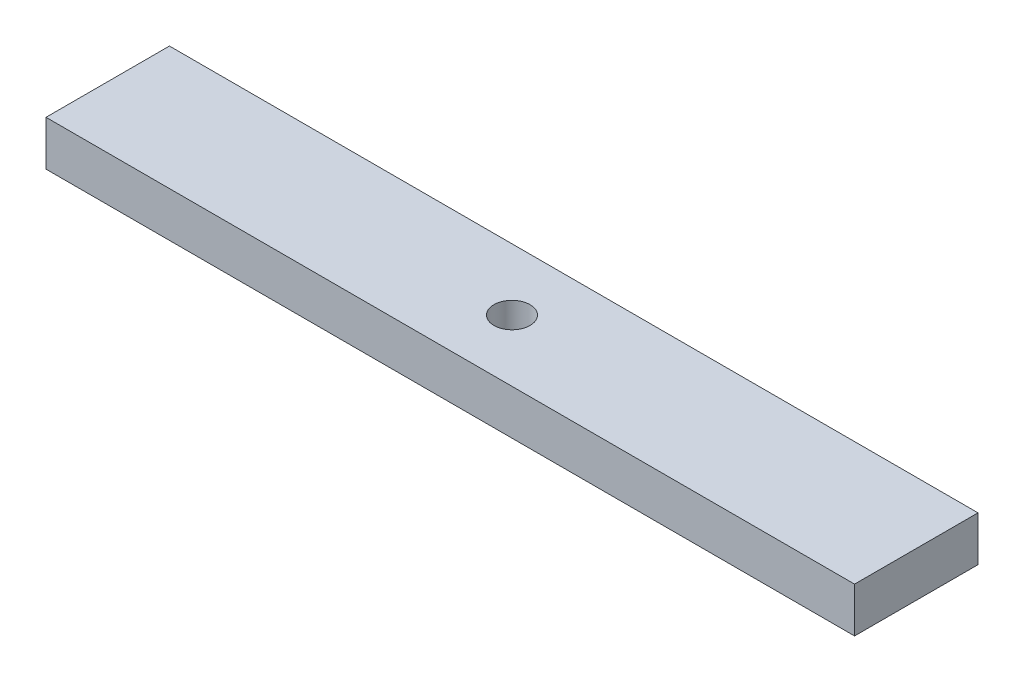
ISO-10303-21;
HEADER;
FILE_DESCRIPTION(('STEP AP214'),'2;1');
FILE_NAME('part.step','',(''),(''),'','','');
FILE_SCHEMA(('AUTOMOTIVE_DESIGN { 1 0 10303 214 1 1 1 1 }'));
ENDSEC;
DATA;
#1=APPLICATION_CONTEXT('core data for automotive mechanical design processes');
#2=APPLICATION_PROTOCOL_DEFINITION('international standard','automotive_design',2000,#1);
#3=PRODUCT_CONTEXT('',#1,'mechanical');
#4=PRODUCT('Part','Part','',(#3));
#5=PRODUCT_RELATED_PRODUCT_CATEGORY('part','',(#4));
#6=PRODUCT_DEFINITION_FORMATION('','',#4);
#7=PRODUCT_DEFINITION_CONTEXT('part definition',#1,'design');
#8=PRODUCT_DEFINITION('design','',#6,#7);
#9=PRODUCT_DEFINITION_SHAPE('','',#8);
#10=(LENGTH_UNIT() NAMED_UNIT(*) SI_UNIT(.MILLI.,.METRE.));
#11=(NAMED_UNIT(*) PLANE_ANGLE_UNIT() SI_UNIT($,.RADIAN.));
#12=(NAMED_UNIT(*) SI_UNIT($,.STERADIAN.) SOLID_ANGLE_UNIT());
#13=UNCERTAINTY_MEASURE_WITH_UNIT(LENGTH_MEASURE(1.E-05),#10,'distance_accuracy_value','');
#14=(GEOMETRIC_REPRESENTATION_CONTEXT(3) GLOBAL_UNCERTAINTY_ASSIGNED_CONTEXT((#13)) GLOBAL_UNIT_ASSIGNED_CONTEXT((#10,
#11,#12)) REPRESENTATION_CONTEXT('',''));
#15=CARTESIAN_POINT('',(0.,0.,0.));
#16=DIRECTION('',(0.,0.,1.));
#17=DIRECTION('',(1.,0.,0.));
#18=AXIS2_PLACEMENT_3D('',#15,#16,#17);
#19=CARTESIAN_POINT('',(0.,6.35,0.));
#20=DIRECTION('',(0.,-1.,0.));
#21=DIRECTION('',(0.,0.,-1.));
#22=AXIS2_PLACEMENT_3D('',#19,#20,#21);
#23=PLANE('',#22);
#24=DIRECTION('',(0.,0.,-1.));
#25=VECTOR('',#24,1.);
#26=CARTESIAN_POINT('',(57.1500000000001,6.35,8.72490000000001));
#27=LINE('',#26,#25);
#28=CARTESIAN_POINT('',(57.1500000000001,6.35,8.72490000000001));
#29=VERTEX_POINT('',#28);
#30=CARTESIAN_POINT('',(57.1500000000001,6.35,-8.72490000000002));
#31=VERTEX_POINT('',#30);
#32=EDGE_CURVE('E85',#29,#31,#27,.T.);
#33=ORIENTED_EDGE('',*,*,#32,.T.);
#34=DIRECTION('',(-1.,0.,0.));
#35=VECTOR('',#34,1.);
#36=CARTESIAN_POINT('',(-57.1499999999999,6.35,-8.72489999999999));
#37=LINE('',#36,#35);
#38=CARTESIAN_POINT('',(-57.1499999999999,6.35,-8.72489999999999));
#39=VERTEX_POINT('',#38);
#40=EDGE_CURVE('E80',#31,#39,#37,.T.);
#41=ORIENTED_EDGE('',*,*,#40,.T.);
#42=DIRECTION('',(0.,0.,1.));
#43=VECTOR('',#42,1.);
#44=CARTESIAN_POINT('',(-57.1499999999999,6.35,8.72490000000001));
#45=LINE('',#44,#43);
#46=CARTESIAN_POINT('',(-57.1499999999999,6.35,8.72490000000001));
#47=VERTEX_POINT('',#46);
#48=EDGE_CURVE('E83',#39,#47,#45,.T.);
#49=ORIENTED_EDGE('',*,*,#48,.T.);
#50=DIRECTION('',(1.,0.,0.));
#51=VECTOR('',#50,1.);
#52=CARTESIAN_POINT('',(-57.1499999999999,6.35,8.72490000000001));
#53=LINE('',#52,#51);
#54=EDGE_CURVE('E50',#47,#29,#53,.T.);
#55=ORIENTED_EDGE('',*,*,#54,.T.);
#56=EDGE_LOOP('',(#33,#41,#49,#55));
#57=FACE_BOUND('',#56,.T.);
#58=CARTESIAN_POINT('',(0.,6.35,0.));
#59=DIRECTION('',(0.,1.,0.));
#60=DIRECTION('',(0.,0.,1.));
#61=AXIS2_PLACEMENT_3D('',#58,#59,#60);
#62=CIRCLE('',#61,2.5527);
#63=CARTESIAN_POINT('',(0.,6.35,2.55270000000001));
#64=VERTEX_POINT('',#63);
#65=EDGE_CURVE('E100',#64,#64,#62,.T.);
#66=ORIENTED_EDGE('',*,*,#65,.F.);
#67=EDGE_LOOP('',(#66));
#68=FACE_BOUND('',#67,.T.);
#69=ADVANCED_FACE('F33',(#57,#68),#23,.F.);
#70=CARTESIAN_POINT('',(0.,0.,0.));
#71=DIRECTION('',(0.,-1.,0.));
#72=DIRECTION('',(0.,0.,-1.));
#73=AXIS2_PLACEMENT_3D('',#70,#71,#72);
#74=PLANE('',#73);
#75=DIRECTION('',(0.,0.,-1.));
#76=VECTOR('',#75,1.);
#77=CARTESIAN_POINT('',(57.1500000000001,0.,8.72490000000001));
#78=LINE('',#77,#76);
#79=CARTESIAN_POINT('',(57.1500000000001,0.,8.72490000000001));
#80=VERTEX_POINT('',#79);
#81=CARTESIAN_POINT('',(57.1500000000001,0.,-8.72490000000002));
#82=VERTEX_POINT('',#81);
#83=EDGE_CURVE('E97',#80,#82,#78,.T.);
#84=ORIENTED_EDGE('',*,*,#83,.F.);
#85=DIRECTION('',(1.,0.,0.));
#86=VECTOR('',#85,1.);
#87=CARTESIAN_POINT('',(-57.1499999999999,0.,8.72490000000001));
#88=LINE('',#87,#86);
#89=CARTESIAN_POINT('',(-57.1499999999999,0.,8.72490000000001));
#90=VERTEX_POINT('',#89);
#91=EDGE_CURVE('E73',#90,#80,#88,.T.);
#92=ORIENTED_EDGE('',*,*,#91,.F.);
#93=DIRECTION('',(0.,0.,1.));
#94=VECTOR('',#93,1.);
#95=CARTESIAN_POINT('',(-57.1499999999999,0.,8.72490000000001));
#96=LINE('',#95,#94);
#97=CARTESIAN_POINT('',(-57.1499999999999,0.,-8.72489999999999));
#98=VERTEX_POINT('',#97);
#99=EDGE_CURVE('E67',#98,#90,#96,.T.);
#100=ORIENTED_EDGE('',*,*,#99,.F.);
#101=DIRECTION('',(-1.,0.,0.));
#102=VECTOR('',#101,1.);
#103=CARTESIAN_POINT('',(-57.1499999999999,0.,-8.72489999999999));
#104=LINE('',#103,#102);
#105=EDGE_CURVE('E89',#82,#98,#104,.T.);
#106=ORIENTED_EDGE('',*,*,#105,.F.);
#107=EDGE_LOOP('',(#84,#92,#100,#106));
#108=FACE_BOUND('',#107,.T.);
#109=CARTESIAN_POINT('',(0.,0.,0.));
#110=DIRECTION('',(0.,1.,0.));
#111=DIRECTION('',(0.,0.,1.));
#112=AXIS2_PLACEMENT_3D('',#109,#110,#111);
#113=CIRCLE('',#112,2.5527);
#114=CARTESIAN_POINT('',(0.,0.,2.55270000000001));
#115=VERTEX_POINT('',#114);
#116=EDGE_CURVE('E112',#115,#115,#113,.T.);
#117=ORIENTED_EDGE('',*,*,#116,.T.);
#118=EDGE_LOOP('',(#117));
#119=FACE_BOUND('',#118,.T.);
#120=ADVANCED_FACE('F108',(#108,#119),#74,.T.);
#121=CARTESIAN_POINT('',(57.1500000000001,6.35,8.72490000000001));
#122=DIRECTION('',(-1.,0.,0.));
#123=DIRECTION('',(0.,0.,1.));
#124=AXIS2_PLACEMENT_3D('',#121,#122,#123);
#125=PLANE('',#124);
#126=ORIENTED_EDGE('',*,*,#83,.T.);
#127=DIRECTION('',(0.,-1.,0.));
#128=VECTOR('',#127,1.);
#129=CARTESIAN_POINT('',(57.1500000000001,6.35,-8.72490000000002));
#130=LINE('',#129,#128);
#131=EDGE_CURVE('E11',#31,#82,#130,.T.);
#132=ORIENTED_EDGE('',*,*,#131,.F.);
#133=ORIENTED_EDGE('',*,*,#32,.F.);
#134=DIRECTION('',(0.,-1.,0.));
#135=VECTOR('',#134,1.);
#136=CARTESIAN_POINT('',(57.1500000000001,6.35,8.72490000000001));
#137=LINE('',#136,#135);
#138=EDGE_CURVE('E93',#29,#80,#137,.T.);
#139=ORIENTED_EDGE('',*,*,#138,.T.);
#140=EDGE_LOOP('',(#126,#132,#133,#139));
#141=FACE_BOUND('',#140,.T.);
#142=ADVANCED_FACE('F35',(#141),#125,.F.);
#143=CARTESIAN_POINT('',(-57.1499999999999,6.35,-8.72489999999999));
#144=DIRECTION('',(0.,0.,1.));
#145=DIRECTION('',(1.,0.,0.));
#146=AXIS2_PLACEMENT_3D('',#143,#144,#145);
#147=PLANE('',#146);
#148=ORIENTED_EDGE('',*,*,#105,.T.);
#149=DIRECTION('',(0.,-1.,0.));
#150=VECTOR('',#149,1.);
#151=CARTESIAN_POINT('',(-57.1499999999999,6.35,-8.72489999999999));
#152=LINE('',#151,#150);
#153=EDGE_CURVE('E42',#39,#98,#152,.T.);
#154=ORIENTED_EDGE('',*,*,#153,.F.);
#155=ORIENTED_EDGE('',*,*,#40,.F.);
#156=ORIENTED_EDGE('',*,*,#131,.T.);
#157=EDGE_LOOP('',(#148,#154,#155,#156));
#158=FACE_BOUND('',#157,.T.);
#159=ADVANCED_FACE('F88',(#158),#147,.F.);
#160=CARTESIAN_POINT('',(-57.1499999999999,6.35,8.72490000000001));
#161=DIRECTION('',(1.,0.,0.));
#162=DIRECTION('',(0.,0.,-1.));
#163=AXIS2_PLACEMENT_3D('',#160,#161,#162);
#164=PLANE('',#163);
#165=ORIENTED_EDGE('',*,*,#99,.T.);
#166=DIRECTION('',(0.,-1.,0.));
#167=VECTOR('',#166,1.);
#168=CARTESIAN_POINT('',(-57.1499999999999,6.35,8.72490000000001));
#169=LINE('',#168,#167);
#170=EDGE_CURVE('E90',#47,#90,#169,.T.);
#171=ORIENTED_EDGE('',*,*,#170,.F.);
#172=ORIENTED_EDGE('',*,*,#48,.F.);
#173=ORIENTED_EDGE('',*,*,#153,.T.);
#174=EDGE_LOOP('',(#165,#171,#172,#173));
#175=FACE_BOUND('',#174,.T.);
#176=ADVANCED_FACE('F91',(#175),#164,.F.);
#177=CARTESIAN_POINT('',(-57.1499999999999,6.35,8.72490000000001));
#178=DIRECTION('',(0.,0.,-1.));
#179=DIRECTION('',(-1.,0.,0.));
#180=AXIS2_PLACEMENT_3D('',#177,#178,#179);
#181=PLANE('',#180);
#182=ORIENTED_EDGE('',*,*,#91,.T.);
#183=ORIENTED_EDGE('',*,*,#138,.F.);
#184=ORIENTED_EDGE('',*,*,#54,.F.);
#185=ORIENTED_EDGE('',*,*,#170,.T.);
#186=EDGE_LOOP('',(#182,#183,#184,#185));
#187=FACE_BOUND('',#186,.T.);
#188=ADVANCED_FACE('F105',(#187),#181,.F.);
#189=CARTESIAN_POINT('',(0.,6.35,0.));
#190=DIRECTION('',(0.,-1.,0.));
#191=DIRECTION('',(0.,0.,-1.));
#192=AXIS2_PLACEMENT_3D('',#189,#190,#191);
#193=CYLINDRICAL_SURFACE('',#192,2.5527);
#194=ORIENTED_EDGE('',*,*,#65,.T.);
#195=EDGE_LOOP('',(#194));
#196=FACE_BOUND('',#195,.T.);
#197=ORIENTED_EDGE('',*,*,#116,.F.);
#198=EDGE_LOOP('',(#197));
#199=FACE_BOUND('',#198,.T.);
#200=ADVANCED_FACE('F118',(#196,#199),#193,.F.);
#201=CLOSED_SHELL('',(#69,#120,#142,#159,#176,#188,#200));
#202=MANIFOLD_SOLID_BREP('B2',#201);
#203=ADVANCED_BREP_SHAPE_REPRESENTATION('',(#18,#202),#14);
#204=SHAPE_DEFINITION_REPRESENTATION(#9,#203);
ENDSEC;
END-ISO-10303-21;
